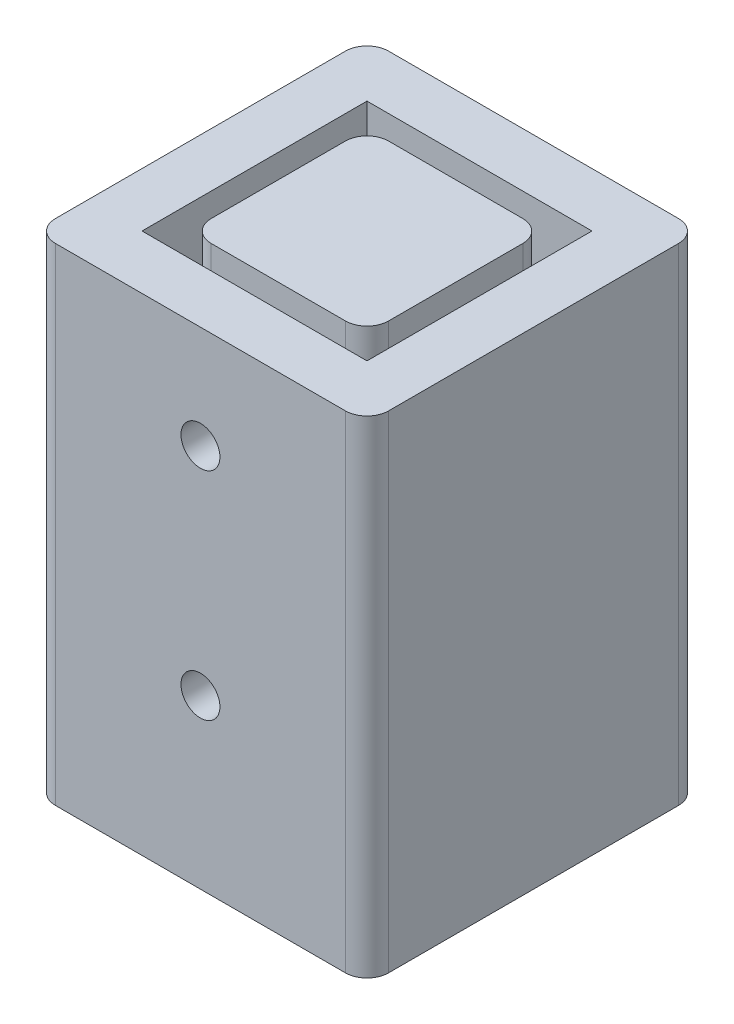
ISO-10303-21;
HEADER;
FILE_DESCRIPTION(('STEP AP214'),'2;1');
FILE_NAME('part.step','',(''),(''),'','','');
FILE_SCHEMA(('AUTOMOTIVE_DESIGN { 1 0 10303 214 1 1 1 1 }'));
ENDSEC;
DATA;
#1=APPLICATION_CONTEXT('core data for automotive mechanical design processes');
#2=APPLICATION_PROTOCOL_DEFINITION('international standard','automotive_design',2000,#1);
#3=PRODUCT_CONTEXT('',#1,'mechanical');
#4=PRODUCT('Part','Part','',(#3));
#5=PRODUCT_RELATED_PRODUCT_CATEGORY('part','',(#4));
#6=PRODUCT_DEFINITION_FORMATION('','',#4);
#7=PRODUCT_DEFINITION_CONTEXT('part definition',#1,'design');
#8=PRODUCT_DEFINITION('design','',#6,#7);
#9=PRODUCT_DEFINITION_SHAPE('','',#8);
#10=(LENGTH_UNIT() NAMED_UNIT(*) SI_UNIT(.MILLI.,.METRE.));
#11=(NAMED_UNIT(*) PLANE_ANGLE_UNIT() SI_UNIT($,.RADIAN.));
#12=(NAMED_UNIT(*) SI_UNIT($,.STERADIAN.) SOLID_ANGLE_UNIT());
#13=UNCERTAINTY_MEASURE_WITH_UNIT(LENGTH_MEASURE(1.E-05),#10,'distance_accuracy_value','');
#14=(GEOMETRIC_REPRESENTATION_CONTEXT(3) GLOBAL_UNCERTAINTY_ASSIGNED_CONTEXT((#13)) GLOBAL_UNIT_ASSIGNED_CONTEXT((#10,
#11,#12)) REPRESENTATION_CONTEXT('',''));
#15=CARTESIAN_POINT('',(0.,0.,0.));
#16=DIRECTION('',(0.,0.,1.));
#17=DIRECTION('',(1.,0.,0.));
#18=AXIS2_PLACEMENT_3D('',#15,#16,#17);
#19=CARTESIAN_POINT('',(0.,50.8,-10.414));
#20=DIRECTION('',(0.,0.,1.));
#21=DIRECTION('',(1.,0.,0.));
#22=AXIS2_PLACEMENT_3D('',#19,#20,#21);
#23=PLANE('',#22);
#24=CARTESIAN_POINT('',(0.,13.335,-10.414));
#25=DIRECTION('',(0.,0.,1.));
#26=DIRECTION('',(1.,0.,0.));
#27=AXIS2_PLACEMENT_3D('',#24,#25,#26);
#28=CIRCLE('',#27,2.286);
#29=CARTESIAN_POINT('',(2.286,13.335,-10.414));
#30=VERTEX_POINT('',#29);
#31=EDGE_CURVE('E268',#30,#30,#28,.T.);
#32=ORIENTED_EDGE('',*,*,#31,.T.);
#33=EDGE_LOOP('',(#32));
#34=FACE_BOUND('',#33,.T.);
#35=CARTESIAN_POINT('',(0.,38.735,-10.414));
#36=DIRECTION('',(0.,0.,1.));
#37=DIRECTION('',(1.,0.,0.));
#38=AXIS2_PLACEMENT_3D('',#35,#36,#37);
#39=CIRCLE('',#38,2.286);
#40=CARTESIAN_POINT('',(2.286,38.735,-10.414));
#41=VERTEX_POINT('',#40);
#42=EDGE_CURVE('E264',#41,#41,#39,.T.);
#43=ORIENTED_EDGE('',*,*,#42,.T.);
#44=EDGE_LOOP('',(#43));
#45=FACE_BOUND('',#44,.T.);
#46=DIRECTION('',(-1.,0.,0.));
#47=VECTOR('',#46,1.);
#48=CARTESIAN_POINT('',(0.,0.,-10.414));
#49=LINE('',#48,#47);
#50=CARTESIAN_POINT('',(7.874,0.,-10.414));
#51=VERTEX_POINT('',#50);
#52=CARTESIAN_POINT('',(-7.874,0.,-10.414));
#53=VERTEX_POINT('',#52);
#54=EDGE_CURVE('E271',#51,#53,#49,.T.);
#55=ORIENTED_EDGE('',*,*,#54,.T.);
#56=DIRECTION('',(0.,-1.,0.));
#57=VECTOR('',#56,1.);
#58=CARTESIAN_POINT('',(-7.874,50.8,-10.414));
#59=LINE('',#58,#57);
#60=CARTESIAN_POINT('',(-7.874,50.8,-10.414));
#61=VERTEX_POINT('',#60);
#62=EDGE_CURVE('E307',#53,#61,#59,.F.);
#63=ORIENTED_EDGE('',*,*,#62,.T.);
#64=DIRECTION('',(-1.,0.,0.));
#65=VECTOR('',#64,1.);
#66=CARTESIAN_POINT('',(0.,50.8,-10.414));
#67=LINE('',#66,#65);
#68=CARTESIAN_POINT('',(7.874,50.8,-10.414));
#69=VERTEX_POINT('',#68);
#70=EDGE_CURVE('E272',#69,#61,#67,.T.);
#71=ORIENTED_EDGE('',*,*,#70,.F.);
#72=DIRECTION('',(0.,-1.,0.));
#73=VECTOR('',#72,1.);
#74=CARTESIAN_POINT('',(7.874,0.,-10.414));
#75=LINE('',#74,#73);
#76=EDGE_CURVE('E304',#69,#51,#75,.T.);
#77=ORIENTED_EDGE('',*,*,#76,.T.);
#78=EDGE_LOOP('',(#55,#63,#71,#77));
#79=FACE_BOUND('',#78,.T.);
#80=ADVANCED_FACE('F61',(#34,#45,#79),#23,.F.);
#81=CARTESIAN_POINT('',(-10.414,50.8,0.));
#82=DIRECTION('',(1.,0.,0.));
#83=DIRECTION('',(0.,0.,-1.));
#84=AXIS2_PLACEMENT_3D('',#81,#82,#83);
#85=PLANE('',#84);
#86=DIRECTION('',(0.,0.,1.));
#87=VECTOR('',#86,1.);
#88=CARTESIAN_POINT('',(-10.414,50.8,0.));
#89=LINE('',#88,#87);
#90=CARTESIAN_POINT('',(-10.414,50.8,-7.874));
#91=VERTEX_POINT('',#90);
#92=CARTESIAN_POINT('',(-10.414,50.8,7.874));
#93=VERTEX_POINT('',#92);
#94=EDGE_CURVE('E275',#91,#93,#89,.T.);
#95=ORIENTED_EDGE('',*,*,#94,.F.);
#96=DIRECTION('',(0.,-1.,0.));
#97=VECTOR('',#96,1.);
#98=CARTESIAN_POINT('',(-10.414,50.8,-7.874));
#99=LINE('',#98,#97);
#100=CARTESIAN_POINT('',(-10.414,0.,-7.874));
#101=VERTEX_POINT('',#100);
#102=EDGE_CURVE('E301',#91,#101,#99,.T.);
#103=ORIENTED_EDGE('',*,*,#102,.T.);
#104=DIRECTION('',(0.,0.,1.));
#105=VECTOR('',#104,1.);
#106=CARTESIAN_POINT('',(-10.414,0.,0.));
#107=LINE('',#106,#105);
#108=CARTESIAN_POINT('',(-10.414,0.,7.874));
#109=VERTEX_POINT('',#108);
#110=EDGE_CURVE('E288',#101,#109,#107,.T.);
#111=ORIENTED_EDGE('',*,*,#110,.T.);
#112=DIRECTION('',(0.,-1.,0.));
#113=VECTOR('',#112,1.);
#114=CARTESIAN_POINT('',(-10.414,50.8,7.874));
#115=LINE('',#114,#113);
#116=EDGE_CURVE('E285',#109,#93,#115,.F.);
#117=ORIENTED_EDGE('',*,*,#116,.T.);
#118=EDGE_LOOP('',(#95,#103,#111,#117));
#119=FACE_BOUND('',#118,.T.);
#120=ADVANCED_FACE('F374',(#119),#85,.F.);
#121=CARTESIAN_POINT('',(0.,50.8,10.414));
#122=DIRECTION('',(0.,0.,1.));
#123=DIRECTION('',(1.,0.,0.));
#124=AXIS2_PLACEMENT_3D('',#121,#122,#123);
#125=PLANE('',#124);
#126=CARTESIAN_POINT('',(0.,13.335,10.414));
#127=DIRECTION('',(0.,0.,1.));
#128=DIRECTION('',(1.,0.,0.));
#129=AXIS2_PLACEMENT_3D('',#126,#127,#128);
#130=CIRCLE('',#129,2.286);
#131=CARTESIAN_POINT('',(2.286,13.335,10.414));
#132=VERTEX_POINT('',#131);
#133=EDGE_CURVE('E267',#132,#132,#130,.T.);
#134=ORIENTED_EDGE('',*,*,#133,.F.);
#135=EDGE_LOOP('',(#134));
#136=FACE_BOUND('',#135,.T.);
#137=CARTESIAN_POINT('',(0.,38.735,10.414));
#138=DIRECTION('',(0.,0.,1.));
#139=DIRECTION('',(1.,0.,0.));
#140=AXIS2_PLACEMENT_3D('',#137,#138,#139);
#141=CIRCLE('',#140,2.286);
#142=CARTESIAN_POINT('',(2.286,38.735,10.414));
#143=VERTEX_POINT('',#142);
#144=EDGE_CURVE('E263',#143,#143,#141,.T.);
#145=ORIENTED_EDGE('',*,*,#144,.F.);
#146=EDGE_LOOP('',(#145));
#147=FACE_BOUND('',#146,.T.);
#148=DIRECTION('',(-1.,0.,0.));
#149=VECTOR('',#148,1.);
#150=CARTESIAN_POINT('',(0.,50.8,10.414));
#151=LINE('',#150,#149);
#152=CARTESIAN_POINT('',(7.874,50.8,10.414));
#153=VERTEX_POINT('',#152);
#154=CARTESIAN_POINT('',(-7.874,50.8,10.414));
#155=VERTEX_POINT('',#154);
#156=EDGE_CURVE('E279',#153,#155,#151,.T.);
#157=ORIENTED_EDGE('',*,*,#156,.T.);
#158=DIRECTION('',(0.,-1.,0.));
#159=VECTOR('',#158,1.);
#160=CARTESIAN_POINT('',(-7.874,0.,10.414));
#161=LINE('',#160,#159);
#162=CARTESIAN_POINT('',(-7.874,0.,10.414));
#163=VERTEX_POINT('',#162);
#164=EDGE_CURVE('E324',#155,#163,#161,.T.);
#165=ORIENTED_EDGE('',*,*,#164,.T.);
#166=DIRECTION('',(-1.,0.,0.));
#167=VECTOR('',#166,1.);
#168=CARTESIAN_POINT('',(0.,0.,10.414));
#169=LINE('',#168,#167);
#170=CARTESIAN_POINT('',(7.874,0.,10.414));
#171=VERTEX_POINT('',#170);
#172=EDGE_CURVE('E291',#171,#163,#169,.T.);
#173=ORIENTED_EDGE('',*,*,#172,.F.);
#174=DIRECTION('',(0.,-1.,0.));
#175=VECTOR('',#174,1.);
#176=CARTESIAN_POINT('',(7.874,50.8,10.414));
#177=LINE('',#176,#175);
#178=EDGE_CURVE('E322',#171,#153,#177,.F.);
#179=ORIENTED_EDGE('',*,*,#178,.T.);
#180=EDGE_LOOP('',(#157,#165,#173,#179));
#181=FACE_BOUND('',#180,.T.);
#182=ADVANCED_FACE('F383',(#136,#147,#181),#125,.T.);
#183=CARTESIAN_POINT('',(10.414,50.8,0.));
#184=DIRECTION('',(1.,0.,0.));
#185=DIRECTION('',(0.,0.,-1.));
#186=AXIS2_PLACEMENT_3D('',#183,#184,#185);
#187=PLANE('',#186);
#188=DIRECTION('',(0.,0.,1.));
#189=VECTOR('',#188,1.);
#190=CARTESIAN_POINT('',(10.414,0.,0.));
#191=LINE('',#190,#189);
#192=CARTESIAN_POINT('',(10.414,0.,-7.874));
#193=VERTEX_POINT('',#192);
#194=CARTESIAN_POINT('',(10.414,0.,7.874));
#195=VERTEX_POINT('',#194);
#196=EDGE_CURVE('E276',#193,#195,#191,.T.);
#197=ORIENTED_EDGE('',*,*,#196,.F.);
#198=DIRECTION('',(0.,-1.,0.));
#199=VECTOR('',#198,1.);
#200=CARTESIAN_POINT('',(10.414,50.8,-7.874));
#201=LINE('',#200,#199);
#202=CARTESIAN_POINT('',(10.414,50.8,-7.874));
#203=VERTEX_POINT('',#202);
#204=EDGE_CURVE('E320',#193,#203,#201,.F.);
#205=ORIENTED_EDGE('',*,*,#204,.T.);
#206=DIRECTION('',(0.,0.,1.));
#207=VECTOR('',#206,1.);
#208=CARTESIAN_POINT('',(10.414,50.8,0.));
#209=LINE('',#208,#207);
#210=CARTESIAN_POINT('',(10.414,50.8,7.874));
#211=VERTEX_POINT('',#210);
#212=EDGE_CURVE('E282',#203,#211,#209,.T.);
#213=ORIENTED_EDGE('',*,*,#212,.T.);
#214=DIRECTION('',(0.,-1.,0.));
#215=VECTOR('',#214,1.);
#216=CARTESIAN_POINT('',(10.414,50.8,7.874));
#217=LINE('',#216,#215);
#218=EDGE_CURVE('E317',#211,#195,#217,.T.);
#219=ORIENTED_EDGE('',*,*,#218,.T.);
#220=EDGE_LOOP('',(#197,#205,#213,#219));
#221=FACE_BOUND('',#220,.T.);
#222=ADVANCED_FACE('F392',(#221),#187,.T.);
#223=CARTESIAN_POINT('',(0.,50.8,0.));
#224=DIRECTION('',(0.,1.,0.));
#225=DIRECTION('',(0.,0.,1.));
#226=AXIS2_PLACEMENT_3D('',#223,#224,#225);
#227=PLANE('',#226);
#228=ORIENTED_EDGE('',*,*,#70,.T.);
#229=CARTESIAN_POINT('',(-7.874,50.8,-7.874));
#230=DIRECTION('',(0.,1.,0.));
#231=DIRECTION('',(0.,0.,1.));
#232=AXIS2_PLACEMENT_3D('',#229,#230,#231);
#233=CIRCLE('',#232,2.54);
#234=EDGE_CURVE('E315',#61,#91,#233,.T.);
#235=ORIENTED_EDGE('',*,*,#234,.T.);
#236=ORIENTED_EDGE('',*,*,#94,.T.);
#237=CARTESIAN_POINT('',(-7.874,50.8,7.874));
#238=DIRECTION('',(0.,1.,0.));
#239=DIRECTION('',(0.,0.,1.));
#240=AXIS2_PLACEMENT_3D('',#237,#238,#239);
#241=CIRCLE('',#240,2.54);
#242=EDGE_CURVE('E311',#93,#155,#241,.T.);
#243=ORIENTED_EDGE('',*,*,#242,.T.);
#244=ORIENTED_EDGE('',*,*,#156,.F.);
#245=CARTESIAN_POINT('',(7.874,50.8,7.874));
#246=DIRECTION('',(0.,1.,0.));
#247=DIRECTION('',(0.,0.,1.));
#248=AXIS2_PLACEMENT_3D('',#245,#246,#247);
#249=CIRCLE('',#248,2.54);
#250=EDGE_CURVE('E309',#153,#211,#249,.T.);
#251=ORIENTED_EDGE('',*,*,#250,.T.);
#252=ORIENTED_EDGE('',*,*,#212,.F.);
#253=CARTESIAN_POINT('',(7.874,50.8,-7.874));
#254=DIRECTION('',(0.,1.,0.));
#255=DIRECTION('',(0.,0.,1.));
#256=AXIS2_PLACEMENT_3D('',#253,#254,#255);
#257=CIRCLE('',#256,2.54);
#258=EDGE_CURVE('E313',#203,#69,#257,.T.);
#259=ORIENTED_EDGE('',*,*,#258,.T.);
#260=EDGE_LOOP('',(#228,#235,#236,#243,#244,#251,#252,#259));
#261=FACE_BOUND('',#260,.T.);
#262=ADVANCED_FACE('F380',(#261),#227,.T.);
#263=CARTESIAN_POINT('',(0.,38.735,-19.558));
#264=DIRECTION('',(0.,0.,1.));
#265=DIRECTION('',(1.,0.,0.));
#266=AXIS2_PLACEMENT_3D('',#263,#264,#265);
#267=CYLINDRICAL_SURFACE('',#266,2.286);
#268=ORIENTED_EDGE('',*,*,#144,.T.);
#269=EDGE_LOOP('',(#268));
#270=FACE_BOUND('',#269,.T.);
#271=ORIENTED_EDGE('',*,*,#42,.F.);
#272=EDGE_LOOP('',(#271));
#273=FACE_BOUND('',#272,.T.);
#274=ADVANCED_FACE('F430',(#270,#273),#267,.F.);
#275=CARTESIAN_POINT('',(0.,13.335,-19.558));
#276=DIRECTION('',(0.,0.,1.));
#277=DIRECTION('',(1.,0.,0.));
#278=AXIS2_PLACEMENT_3D('',#275,#276,#277);
#279=CYLINDRICAL_SURFACE('',#278,2.286);
#280=ORIENTED_EDGE('',*,*,#133,.T.);
#281=EDGE_LOOP('',(#280));
#282=FACE_BOUND('',#281,.T.);
#283=ORIENTED_EDGE('',*,*,#31,.F.);
#284=EDGE_LOOP('',(#283));
#285=FACE_BOUND('',#284,.T.);
#286=ADVANCED_FACE('F433',(#282,#285),#279,.F.);
#287=CARTESIAN_POINT('',(0.,0.,0.));
#288=DIRECTION('',(0.,1.,0.));
#289=DIRECTION('',(0.,0.,1.));
#290=AXIS2_PLACEMENT_3D('',#287,#288,#289);
#291=PLANE('',#290);
#292=DIRECTION('',(0.,0.,-1.));
#293=VECTOR('',#292,1.);
#294=CARTESIAN_POINT('',(13.208,0.,0.));
#295=LINE('',#294,#293);
#296=CARTESIAN_POINT('',(13.208,0.,13.208));
#297=VERTEX_POINT('',#296);
#298=CARTESIAN_POINT('',(13.208,0.,-13.208));
#299=VERTEX_POINT('',#298);
#300=EDGE_CURVE('E204',#297,#299,#295,.T.);
#301=ORIENTED_EDGE('',*,*,#300,.T.);
#302=DIRECTION('',(1.,0.,0.));
#303=VECTOR('',#302,1.);
#304=CARTESIAN_POINT('',(0.,0.,-13.208));
#305=LINE('',#304,#303);
#306=CARTESIAN_POINT('',(-13.208,0.,-13.208));
#307=VERTEX_POINT('',#306);
#308=EDGE_CURVE('E236',#307,#299,#305,.T.);
#309=ORIENTED_EDGE('',*,*,#308,.F.);
#310=DIRECTION('',(0.,0.,-1.));
#311=VECTOR('',#310,1.);
#312=CARTESIAN_POINT('',(-13.208,0.,0.));
#313=LINE('',#312,#311);
#314=CARTESIAN_POINT('',(-13.208,0.,13.208));
#315=VERTEX_POINT('',#314);
#316=EDGE_CURVE('E234',#315,#307,#313,.T.);
#317=ORIENTED_EDGE('',*,*,#316,.F.);
#318=DIRECTION('',(1.,0.,0.));
#319=VECTOR('',#318,1.);
#320=CARTESIAN_POINT('',(0.,0.,13.208));
#321=LINE('',#320,#319);
#322=EDGE_CURVE('E231',#315,#297,#321,.T.);
#323=ORIENTED_EDGE('',*,*,#322,.T.);
#324=EDGE_LOOP('',(#301,#309,#317,#323));
#325=FACE_BOUND('',#324,.T.);
#326=ORIENTED_EDGE('',*,*,#54,.F.);
#327=CARTESIAN_POINT('',(7.874,0.,-7.874));
#328=DIRECTION('',(0.,1.,0.));
#329=DIRECTION('',(0.,0.,1.));
#330=AXIS2_PLACEMENT_3D('',#327,#328,#329);
#331=CIRCLE('',#330,2.54);
#332=EDGE_CURVE('E363',#51,#193,#331,.F.);
#333=ORIENTED_EDGE('',*,*,#332,.T.);
#334=ORIENTED_EDGE('',*,*,#196,.T.);
#335=CARTESIAN_POINT('',(7.874,0.,7.874));
#336=DIRECTION('',(0.,1.,0.));
#337=DIRECTION('',(0.,0.,1.));
#338=AXIS2_PLACEMENT_3D('',#335,#336,#337);
#339=CIRCLE('',#338,2.54);
#340=EDGE_CURVE('E12',#195,#171,#339,.F.);
#341=ORIENTED_EDGE('',*,*,#340,.T.);
#342=ORIENTED_EDGE('',*,*,#172,.T.);
#343=CARTESIAN_POINT('',(-7.874,0.,7.874));
#344=DIRECTION('',(0.,1.,0.));
#345=DIRECTION('',(0.,0.,1.));
#346=AXIS2_PLACEMENT_3D('',#343,#344,#345);
#347=CIRCLE('',#346,2.54);
#348=EDGE_CURVE('E69',#163,#109,#347,.F.);
#349=ORIENTED_EDGE('',*,*,#348,.T.);
#350=ORIENTED_EDGE('',*,*,#110,.F.);
#351=CARTESIAN_POINT('',(-7.874,0.,-7.874));
#352=DIRECTION('',(0.,1.,0.));
#353=DIRECTION('',(0.,0.,1.));
#354=AXIS2_PLACEMENT_3D('',#351,#352,#353);
#355=CIRCLE('',#354,2.54);
#356=EDGE_CURVE('E361',#101,#53,#355,.F.);
#357=ORIENTED_EDGE('',*,*,#356,.T.);
#358=EDGE_LOOP('',(#326,#333,#334,#341,#342,#349,#350,#357));
#359=FACE_BOUND('',#358,.T.);
#360=ADVANCED_FACE('F367',(#325,#359),#291,.T.);
#361=CARTESIAN_POINT('',(13.208,50.8,0.));
#362=DIRECTION('',(-1.,0.,0.));
#363=DIRECTION('',(0.,0.,1.));
#364=AXIS2_PLACEMENT_3D('',#361,#362,#363);
#365=PLANE('',#364);
#366=ORIENTED_EDGE('',*,*,#300,.F.);
#367=DIRECTION('',(0.,-1.,0.));
#368=VECTOR('',#367,1.);
#369=CARTESIAN_POINT('',(13.208,50.8,13.208));
#370=LINE('',#369,#368);
#371=CARTESIAN_POINT('',(13.208,50.8,13.208));
#372=VERTEX_POINT('',#371);
#373=EDGE_CURVE('E199',#372,#297,#370,.T.);
#374=ORIENTED_EDGE('',*,*,#373,.F.);
#375=DIRECTION('',(0.,0.,-1.));
#376=VECTOR('',#375,1.);
#377=CARTESIAN_POINT('',(13.208,50.8,0.));
#378=LINE('',#377,#376);
#379=CARTESIAN_POINT('',(13.208,50.8,-13.208));
#380=VERTEX_POINT('',#379);
#381=EDGE_CURVE('E202',#372,#380,#378,.T.);
#382=ORIENTED_EDGE('',*,*,#381,.T.);
#383=DIRECTION('',(0.,-1.,0.));
#384=VECTOR('',#383,1.);
#385=CARTESIAN_POINT('',(13.208,50.8,-13.208));
#386=LINE('',#385,#384);
#387=EDGE_CURVE('E229',#380,#299,#386,.T.);
#388=ORIENTED_EDGE('',*,*,#387,.T.);
#389=EDGE_LOOP('',(#366,#374,#382,#388));
#390=FACE_BOUND('',#389,.T.);
#391=ADVANCED_FACE('F201',(#390),#365,.T.);
#392=CARTESIAN_POINT('',(0.,50.8,13.208));
#393=DIRECTION('',(0.,0.,-1.));
#394=DIRECTION('',(-1.,0.,0.));
#395=AXIS2_PLACEMENT_3D('',#392,#393,#394);
#396=PLANE('',#395);
#397=CARTESIAN_POINT('',(0.,13.335,13.208));
#398=DIRECTION('',(0.,0.,-1.));
#399=DIRECTION('',(-1.,0.,0.));
#400=AXIS2_PLACEMENT_3D('',#397,#398,#399);
#401=CIRCLE('',#400,2.286);
#402=CARTESIAN_POINT('',(-2.286,13.335,13.208));
#403=VERTEX_POINT('',#402);
#404=EDGE_CURVE('E232',#403,#403,#401,.T.);
#405=ORIENTED_EDGE('',*,*,#404,.F.);
#406=EDGE_LOOP('',(#405));
#407=FACE_BOUND('',#406,.T.);
#408=CARTESIAN_POINT('',(0.,38.735,13.208));
#409=DIRECTION('',(0.,0.,-1.));
#410=DIRECTION('',(-1.,0.,0.));
#411=AXIS2_PLACEMENT_3D('',#408,#409,#410);
#412=CIRCLE('',#411,2.286);
#413=CARTESIAN_POINT('',(-2.286,38.735,13.208));
#414=VERTEX_POINT('',#413);
#415=EDGE_CURVE('E248',#414,#414,#412,.T.);
#416=ORIENTED_EDGE('',*,*,#415,.F.);
#417=EDGE_LOOP('',(#416));
#418=FACE_BOUND('',#417,.T.);
#419=ORIENTED_EDGE('',*,*,#322,.F.);
#420=DIRECTION('',(0.,-1.,0.));
#421=VECTOR('',#420,1.);
#422=CARTESIAN_POINT('',(-13.208,50.8,13.208));
#423=LINE('',#422,#421);
#424=CARTESIAN_POINT('',(-13.208,50.8,13.208));
#425=VERTEX_POINT('',#424);
#426=EDGE_CURVE('E210',#425,#315,#423,.T.);
#427=ORIENTED_EDGE('',*,*,#426,.F.);
#428=DIRECTION('',(1.,0.,0.));
#429=VECTOR('',#428,1.);
#430=CARTESIAN_POINT('',(0.,50.8,13.208));
#431=LINE('',#430,#429);
#432=EDGE_CURVE('E216',#425,#372,#431,.T.);
#433=ORIENTED_EDGE('',*,*,#432,.T.);
#434=ORIENTED_EDGE('',*,*,#373,.T.);
#435=EDGE_LOOP('',(#419,#427,#433,#434));
#436=FACE_BOUND('',#435,.T.);
#437=ADVANCED_FACE('F221',(#407,#418,#436),#396,.T.);
#438=CARTESIAN_POINT('',(-13.208,50.8,0.));
#439=DIRECTION('',(-1.,0.,0.));
#440=DIRECTION('',(0.,0.,1.));
#441=AXIS2_PLACEMENT_3D('',#438,#439,#440);
#442=PLANE('',#441);
#443=ORIENTED_EDGE('',*,*,#316,.T.);
#444=DIRECTION('',(0.,-1.,0.));
#445=VECTOR('',#444,1.);
#446=CARTESIAN_POINT('',(-13.208,50.8,-13.208));
#447=LINE('',#446,#445);
#448=CARTESIAN_POINT('',(-13.208,50.8,-13.208));
#449=VERTEX_POINT('',#448);
#450=EDGE_CURVE('E241',#449,#307,#447,.T.);
#451=ORIENTED_EDGE('',*,*,#450,.F.);
#452=DIRECTION('',(0.,0.,-1.));
#453=VECTOR('',#452,1.);
#454=CARTESIAN_POINT('',(-13.208,50.8,0.));
#455=LINE('',#454,#453);
#456=EDGE_CURVE('E223',#425,#449,#455,.T.);
#457=ORIENTED_EDGE('',*,*,#456,.F.);
#458=ORIENTED_EDGE('',*,*,#426,.T.);
#459=EDGE_LOOP('',(#443,#451,#457,#458));
#460=FACE_BOUND('',#459,.T.);
#461=ADVANCED_FACE('F459',(#460),#442,.F.);
#462=CARTESIAN_POINT('',(0.,50.8,-13.208));
#463=DIRECTION('',(0.,0.,-1.));
#464=DIRECTION('',(-1.,0.,0.));
#465=AXIS2_PLACEMENT_3D('',#462,#463,#464);
#466=PLANE('',#465);
#467=CARTESIAN_POINT('',(0.,13.335,-13.208));
#468=DIRECTION('',(0.,0.,-1.));
#469=DIRECTION('',(-1.,0.,0.));
#470=AXIS2_PLACEMENT_3D('',#467,#468,#469);
#471=CIRCLE('',#470,2.286);
#472=CARTESIAN_POINT('',(-2.286,13.335,-13.208));
#473=VERTEX_POINT('',#472);
#474=EDGE_CURVE('E250',#473,#473,#471,.T.);
#475=ORIENTED_EDGE('',*,*,#474,.T.);
#476=EDGE_LOOP('',(#475));
#477=FACE_BOUND('',#476,.T.);
#478=CARTESIAN_POINT('',(0.,38.735,-13.208));
#479=DIRECTION('',(0.,0.,-1.));
#480=DIRECTION('',(-1.,0.,0.));
#481=AXIS2_PLACEMENT_3D('',#478,#479,#480);
#482=CIRCLE('',#481,2.286);
#483=CARTESIAN_POINT('',(-2.286,38.735,-13.208));
#484=VERTEX_POINT('',#483);
#485=EDGE_CURVE('E245',#484,#484,#482,.T.);
#486=ORIENTED_EDGE('',*,*,#485,.T.);
#487=EDGE_LOOP('',(#486));
#488=FACE_BOUND('',#487,.T.);
#489=ORIENTED_EDGE('',*,*,#308,.T.);
#490=ORIENTED_EDGE('',*,*,#387,.F.);
#491=DIRECTION('',(1.,0.,0.));
#492=VECTOR('',#491,1.);
#493=CARTESIAN_POINT('',(0.,50.8,-13.208));
#494=LINE('',#493,#492);
#495=EDGE_CURVE('E217',#449,#380,#494,.T.);
#496=ORIENTED_EDGE('',*,*,#495,.F.);
#497=ORIENTED_EDGE('',*,*,#450,.T.);
#498=EDGE_LOOP('',(#489,#490,#496,#497));
#499=FACE_BOUND('',#498,.T.);
#500=ADVANCED_FACE('F463',(#477,#488,#499),#466,.F.);
#501=CARTESIAN_POINT('',(0.,50.8,0.));
#502=DIRECTION('',(0.,1.,0.));
#503=DIRECTION('',(0.,0.,1.));
#504=AXIS2_PLACEMENT_3D('',#501,#502,#503);
#505=PLANE('',#504);
#506=DIRECTION('',(0.,0.,-1.));
#507=VECTOR('',#506,1.);
#508=CARTESIAN_POINT('',(19.558,50.8,0.));
#509=LINE('',#508,#507);
#510=CARTESIAN_POINT('',(19.558,50.8,17.018));
#511=VERTEX_POINT('',#510);
#512=CARTESIAN_POINT('',(19.558,50.8,-17.018));
#513=VERTEX_POINT('',#512);
#514=EDGE_CURVE('E520',#511,#513,#509,.T.);
#515=ORIENTED_EDGE('',*,*,#514,.T.);
#516=CARTESIAN_POINT('',(17.018,50.8,-17.018));
#517=DIRECTION('',(0.,1.,0.));
#518=DIRECTION('',(0.,0.,1.));
#519=AXIS2_PLACEMENT_3D('',#516,#517,#518);
#520=CIRCLE('',#519,2.54);
#521=CARTESIAN_POINT('',(17.018,50.8,-19.558));
#522=VERTEX_POINT('',#521);
#523=EDGE_CURVE('E338',#513,#522,#520,.T.);
#524=ORIENTED_EDGE('',*,*,#523,.T.);
#525=DIRECTION('',(1.,0.,0.));
#526=VECTOR('',#525,1.);
#527=CARTESIAN_POINT('',(0.,50.8,-19.558));
#528=LINE('',#527,#526);
#529=CARTESIAN_POINT('',(-17.018,50.8,-19.558));
#530=VERTEX_POINT('',#529);
#531=EDGE_CURVE('E219',#530,#522,#528,.T.);
#532=ORIENTED_EDGE('',*,*,#531,.F.);
#533=CARTESIAN_POINT('',(-17.018,50.8,-17.018));
#534=DIRECTION('',(0.,1.,0.));
#535=DIRECTION('',(0.,0.,1.));
#536=AXIS2_PLACEMENT_3D('',#533,#534,#535);
#537=CIRCLE('',#536,2.54);
#538=CARTESIAN_POINT('',(-19.558,50.8,-17.018));
#539=VERTEX_POINT('',#538);
#540=EDGE_CURVE('E336',#530,#539,#537,.T.);
#541=ORIENTED_EDGE('',*,*,#540,.T.);
#542=DIRECTION('',(0.,0.,-1.));
#543=VECTOR('',#542,1.);
#544=CARTESIAN_POINT('',(-19.558,50.8,0.));
#545=LINE('',#544,#543);
#546=CARTESIAN_POINT('',(-19.558,50.8,17.018));
#547=VERTEX_POINT('',#546);
#548=EDGE_CURVE('E239',#547,#539,#545,.T.);
#549=ORIENTED_EDGE('',*,*,#548,.F.);
#550=CARTESIAN_POINT('',(-17.018,50.8,17.018));
#551=DIRECTION('',(0.,1.,0.));
#552=DIRECTION('',(0.,0.,1.));
#553=AXIS2_PLACEMENT_3D('',#550,#551,#552);
#554=CIRCLE('',#553,2.54);
#555=CARTESIAN_POINT('',(-17.018,50.8,19.558));
#556=VERTEX_POINT('',#555);
#557=EDGE_CURVE('E332',#547,#556,#554,.T.);
#558=ORIENTED_EDGE('',*,*,#557,.T.);
#559=DIRECTION('',(1.,0.,0.));
#560=VECTOR('',#559,1.);
#561=CARTESIAN_POINT('',(0.,50.8,19.558));
#562=LINE('',#561,#560);
#563=CARTESIAN_POINT('',(17.018,50.8,19.558));
#564=VERTEX_POINT('',#563);
#565=EDGE_CURVE('E517',#556,#564,#562,.T.);
#566=ORIENTED_EDGE('',*,*,#565,.T.);
#567=CARTESIAN_POINT('',(17.018,50.8,17.018));
#568=DIRECTION('',(0.,1.,0.));
#569=DIRECTION('',(0.,0.,1.));
#570=AXIS2_PLACEMENT_3D('',#567,#568,#569);
#571=CIRCLE('',#570,2.54);
#572=EDGE_CURVE('E334',#564,#511,#571,.T.);
#573=ORIENTED_EDGE('',*,*,#572,.T.);
#574=EDGE_LOOP('',(#515,#524,#532,#541,#549,#558,#566,#573));
#575=FACE_BOUND('',#574,.T.);
#576=ORIENTED_EDGE('',*,*,#381,.F.);
#577=ORIENTED_EDGE('',*,*,#432,.F.);
#578=ORIENTED_EDGE('',*,*,#456,.T.);
#579=ORIENTED_EDGE('',*,*,#495,.T.);
#580=EDGE_LOOP('',(#576,#577,#578,#579));
#581=FACE_BOUND('',#580,.T.);
#582=ADVANCED_FACE('F214',(#575,#581),#505,.T.);
#583=CARTESIAN_POINT('',(0.,38.735,-19.558));
#584=DIRECTION('',(0.,0.,1.));
#585=DIRECTION('',(1.,0.,0.));
#586=AXIS2_PLACEMENT_3D('',#583,#584,#585);
#587=CYLINDRICAL_SURFACE('',#586,2.286);
#588=CARTESIAN_POINT('',(0.,38.735,-19.558));
#589=DIRECTION('',(0.,0.,1.));
#590=DIRECTION('',(1.,0.,0.));
#591=AXIS2_PLACEMENT_3D('',#588,#589,#590);
#592=CIRCLE('',#591,2.286);
#593=CARTESIAN_POINT('',(2.286,38.735,-19.558));
#594=VERTEX_POINT('',#593);
#595=EDGE_CURVE('E504',#594,#594,#592,.T.);
#596=ORIENTED_EDGE('',*,*,#595,.F.);
#597=EDGE_LOOP('',(#596));
#598=FACE_BOUND('',#597,.T.);
#599=ORIENTED_EDGE('',*,*,#485,.F.);
#600=EDGE_LOOP('',(#599));
#601=FACE_BOUND('',#600,.T.);
#602=ADVANCED_FACE('F470',(#598,#601),#587,.F.);
#603=CARTESIAN_POINT('',(0.,13.335,-19.558));
#604=DIRECTION('',(0.,0.,1.));
#605=DIRECTION('',(1.,0.,0.));
#606=AXIS2_PLACEMENT_3D('',#603,#604,#605);
#607=CYLINDRICAL_SURFACE('',#606,2.286);
#608=CARTESIAN_POINT('',(0.,13.335,-19.558));
#609=DIRECTION('',(0.,0.,1.));
#610=DIRECTION('',(1.,0.,0.));
#611=AXIS2_PLACEMENT_3D('',#608,#609,#610);
#612=CIRCLE('',#611,2.286);
#613=CARTESIAN_POINT('',(2.286,13.335,-19.558));
#614=VERTEX_POINT('',#613);
#615=EDGE_CURVE('E249',#614,#614,#612,.T.);
#616=ORIENTED_EDGE('',*,*,#615,.F.);
#617=EDGE_LOOP('',(#616));
#618=FACE_BOUND('',#617,.T.);
#619=ORIENTED_EDGE('',*,*,#474,.F.);
#620=EDGE_LOOP('',(#619));
#621=FACE_BOUND('',#620,.T.);
#622=ADVANCED_FACE('F475',(#618,#621),#607,.F.);
#623=ORIENTED_EDGE('',*,*,#415,.T.);
#624=EDGE_LOOP('',(#623));
#625=FACE_BOUND('',#624,.T.);
#626=CARTESIAN_POINT('',(0.,38.735,19.558));
#627=DIRECTION('',(0.,0.,1.));
#628=DIRECTION('',(1.,0.,0.));
#629=AXIS2_PLACEMENT_3D('',#626,#627,#628);
#630=CIRCLE('',#629,2.286);
#631=CARTESIAN_POINT('',(2.286,38.735,19.558));
#632=VERTEX_POINT('',#631);
#633=EDGE_CURVE('E509',#632,#632,#630,.T.);
#634=ORIENTED_EDGE('',*,*,#633,.T.);
#635=EDGE_LOOP('',(#634));
#636=FACE_BOUND('',#635,.T.);
#637=ADVANCED_FACE('F472',(#625,#636),#587,.F.);
#638=ORIENTED_EDGE('',*,*,#404,.T.);
#639=EDGE_LOOP('',(#638));
#640=FACE_BOUND('',#639,.T.);
#641=CARTESIAN_POINT('',(0.,13.335,19.558));
#642=DIRECTION('',(0.,0.,1.));
#643=DIRECTION('',(1.,0.,0.));
#644=AXIS2_PLACEMENT_3D('',#641,#642,#643);
#645=CIRCLE('',#644,2.286);
#646=CARTESIAN_POINT('',(2.286,13.335,19.558));
#647=VERTEX_POINT('',#646);
#648=EDGE_CURVE('E501',#647,#647,#645,.T.);
#649=ORIENTED_EDGE('',*,*,#648,.T.);
#650=EDGE_LOOP('',(#649));
#651=FACE_BOUND('',#650,.T.);
#652=ADVANCED_FACE('F454',(#640,#651),#607,.F.);
#653=CARTESIAN_POINT('',(0.,-6.35,0.));
#654=DIRECTION('',(0.,1.,0.));
#655=DIRECTION('',(0.,0.,1.));
#656=AXIS2_PLACEMENT_3D('',#653,#654,#655);
#657=PLANE('',#656);
#658=DIRECTION('',(1.,0.,0.));
#659=VECTOR('',#658,1.);
#660=CARTESIAN_POINT('',(0.,-6.35,-19.558));
#661=LINE('',#660,#659);
#662=CARTESIAN_POINT('',(-17.018,-6.35,-19.558));
#663=VERTEX_POINT('',#662);
#664=CARTESIAN_POINT('',(17.018,-6.35,-19.558));
#665=VERTEX_POINT('',#664);
#666=EDGE_CURVE('E260',#663,#665,#661,.T.);
#667=ORIENTED_EDGE('',*,*,#666,.T.);
#668=CARTESIAN_POINT('',(17.018,-6.35,-17.018));
#669=DIRECTION('',(0.,1.,0.));
#670=DIRECTION('',(0.,0.,1.));
#671=AXIS2_PLACEMENT_3D('',#668,#669,#670);
#672=CIRCLE('',#671,2.54);
#673=CARTESIAN_POINT('',(19.558,-6.35,-17.018));
#674=VERTEX_POINT('',#673);
#675=EDGE_CURVE('E350',#665,#674,#672,.F.);
#676=ORIENTED_EDGE('',*,*,#675,.T.);
#677=DIRECTION('',(0.,0.,-1.));
#678=VECTOR('',#677,1.);
#679=CARTESIAN_POINT('',(19.558,-6.35,0.));
#680=LINE('',#679,#678);
#681=CARTESIAN_POINT('',(19.558,-6.35,17.018));
#682=VERTEX_POINT('',#681);
#683=EDGE_CURVE('E257',#682,#674,#680,.T.);
#684=ORIENTED_EDGE('',*,*,#683,.F.);
#685=CARTESIAN_POINT('',(17.018,-6.35,17.018));
#686=DIRECTION('',(0.,1.,0.));
#687=DIRECTION('',(0.,0.,1.));
#688=AXIS2_PLACEMENT_3D('',#685,#686,#687);
#689=CIRCLE('',#688,2.54);
#690=CARTESIAN_POINT('',(17.018,-6.35,19.558));
#691=VERTEX_POINT('',#690);
#692=EDGE_CURVE('E76',#682,#691,#689,.F.);
#693=ORIENTED_EDGE('',*,*,#692,.T.);
#694=DIRECTION('',(1.,0.,0.));
#695=VECTOR('',#694,1.);
#696=CARTESIAN_POINT('',(0.,-6.35,19.558));
#697=LINE('',#696,#695);
#698=CARTESIAN_POINT('',(-17.018,-6.35,19.558));
#699=VERTEX_POINT('',#698);
#700=EDGE_CURVE('E255',#699,#691,#697,.T.);
#701=ORIENTED_EDGE('',*,*,#700,.F.);
#702=CARTESIAN_POINT('',(-17.018,-6.35,17.018));
#703=DIRECTION('',(0.,1.,0.));
#704=DIRECTION('',(0.,0.,1.));
#705=AXIS2_PLACEMENT_3D('',#702,#703,#704);
#706=CIRCLE('',#705,2.54);
#707=CARTESIAN_POINT('',(-19.558,-6.35,17.018));
#708=VERTEX_POINT('',#707);
#709=EDGE_CURVE('E345',#699,#708,#706,.F.);
#710=ORIENTED_EDGE('',*,*,#709,.T.);
#711=DIRECTION('',(0.,0.,-1.));
#712=VECTOR('',#711,1.);
#713=CARTESIAN_POINT('',(-19.558,-6.35,0.));
#714=LINE('',#713,#712);
#715=CARTESIAN_POINT('',(-19.558,-6.35,-17.018));
#716=VERTEX_POINT('',#715);
#717=EDGE_CURVE('E209',#708,#716,#714,.T.);
#718=ORIENTED_EDGE('',*,*,#717,.T.);
#719=CARTESIAN_POINT('',(-17.018,-6.35,-17.018));
#720=DIRECTION('',(0.,1.,0.));
#721=DIRECTION('',(0.,0.,1.));
#722=AXIS2_PLACEMENT_3D('',#719,#720,#721);
#723=CIRCLE('',#722,2.54);
#724=EDGE_CURVE('E348',#716,#663,#723,.F.);
#725=ORIENTED_EDGE('',*,*,#724,.T.);
#726=EDGE_LOOP('',(#667,#676,#684,#693,#701,#710,#718,#725));
#727=FACE_BOUND('',#726,.T.);
#728=ADVANCED_FACE('F442',(#727),#657,.F.);
#729=CARTESIAN_POINT('',(0.,-6.35,19.558));
#730=DIRECTION('',(0.,0.,1.));
#731=DIRECTION('',(1.,0.,0.));
#732=AXIS2_PLACEMENT_3D('',#729,#730,#731);
#733=PLANE('',#732);
#734=ORIENTED_EDGE('',*,*,#700,.T.);
#735=DIRECTION('',(0.,1.,0.));
#736=VECTOR('',#735,1.);
#737=CARTESIAN_POINT('',(17.018,-6.35,19.558));
#738=LINE('',#737,#736);
#739=EDGE_CURVE('E358',#691,#564,#738,.T.);
#740=ORIENTED_EDGE('',*,*,#739,.T.);
#741=ORIENTED_EDGE('',*,*,#565,.F.);
#742=DIRECTION('',(0.,1.,0.));
#743=VECTOR('',#742,1.);
#744=CARTESIAN_POINT('',(-17.018,-6.35,19.558));
#745=LINE('',#744,#743);
#746=EDGE_CURVE('E83',#556,#699,#745,.F.);
#747=ORIENTED_EDGE('',*,*,#746,.T.);
#748=EDGE_LOOP('',(#734,#740,#741,#747));
#749=FACE_BOUND('',#748,.T.);
#750=ORIENTED_EDGE('',*,*,#648,.F.);
#751=EDGE_LOOP('',(#750));
#752=FACE_BOUND('',#751,.T.);
#753=ORIENTED_EDGE('',*,*,#633,.F.);
#754=EDGE_LOOP('',(#753));
#755=FACE_BOUND('',#754,.T.);
#756=ADVANCED_FACE('F438',(#749,#752,#755),#733,.T.);
#757=CARTESIAN_POINT('',(19.558,-6.35,0.));
#758=DIRECTION('',(1.,0.,0.));
#759=DIRECTION('',(0.,0.,-1.));
#760=AXIS2_PLACEMENT_3D('',#757,#758,#759);
#761=PLANE('',#760);
#762=ORIENTED_EDGE('',*,*,#683,.T.);
#763=DIRECTION('',(0.,1.,0.));
#764=VECTOR('',#763,1.);
#765=CARTESIAN_POINT('',(19.558,50.8,-17.018));
#766=LINE('',#765,#764);
#767=EDGE_CURVE('E329',#674,#513,#766,.T.);
#768=ORIENTED_EDGE('',*,*,#767,.T.);
#769=ORIENTED_EDGE('',*,*,#514,.F.);
#770=DIRECTION('',(0.,1.,0.));
#771=VECTOR('',#770,1.);
#772=CARTESIAN_POINT('',(19.558,-6.35,17.018));
#773=LINE('',#772,#771);
#774=EDGE_CURVE('E327',#511,#682,#773,.F.);
#775=ORIENTED_EDGE('',*,*,#774,.T.);
#776=EDGE_LOOP('',(#762,#768,#769,#775));
#777=FACE_BOUND('',#776,.T.);
#778=ADVANCED_FACE('F441',(#777),#761,.T.);
#779=CARTESIAN_POINT('',(0.,-6.35,-19.558));
#780=DIRECTION('',(0.,0.,1.));
#781=DIRECTION('',(1.,0.,0.));
#782=AXIS2_PLACEMENT_3D('',#779,#780,#781);
#783=PLANE('',#782);
#784=ORIENTED_EDGE('',*,*,#531,.T.);
#785=DIRECTION('',(0.,1.,0.));
#786=VECTOR('',#785,1.);
#787=CARTESIAN_POINT('',(17.018,-6.35,-19.558));
#788=LINE('',#787,#786);
#789=EDGE_CURVE('E343',#522,#665,#788,.F.);
#790=ORIENTED_EDGE('',*,*,#789,.T.);
#791=ORIENTED_EDGE('',*,*,#666,.F.);
#792=DIRECTION('',(0.,1.,0.));
#793=VECTOR('',#792,1.);
#794=CARTESIAN_POINT('',(-17.018,-6.35,-19.558));
#795=LINE('',#794,#793);
#796=EDGE_CURVE('E340',#663,#530,#795,.T.);
#797=ORIENTED_EDGE('',*,*,#796,.T.);
#798=EDGE_LOOP('',(#784,#790,#791,#797));
#799=FACE_BOUND('',#798,.T.);
#800=ORIENTED_EDGE('',*,*,#615,.T.);
#801=EDGE_LOOP('',(#800));
#802=FACE_BOUND('',#801,.T.);
#803=ORIENTED_EDGE('',*,*,#595,.T.);
#804=EDGE_LOOP('',(#803));
#805=FACE_BOUND('',#804,.T.);
#806=ADVANCED_FACE('F411',(#799,#802,#805),#783,.F.);
#807=CARTESIAN_POINT('',(-19.558,-6.35,0.));
#808=DIRECTION('',(1.,0.,0.));
#809=DIRECTION('',(0.,0.,-1.));
#810=AXIS2_PLACEMENT_3D('',#807,#808,#809);
#811=PLANE('',#810);
#812=ORIENTED_EDGE('',*,*,#548,.T.);
#813=DIRECTION('',(0.,1.,0.));
#814=VECTOR('',#813,1.);
#815=CARTESIAN_POINT('',(-19.558,-6.35,-17.018));
#816=LINE('',#815,#814);
#817=EDGE_CURVE('E355',#539,#716,#816,.F.);
#818=ORIENTED_EDGE('',*,*,#817,.T.);
#819=ORIENTED_EDGE('',*,*,#717,.F.);
#820=DIRECTION('',(0.,1.,0.));
#821=VECTOR('',#820,1.);
#822=CARTESIAN_POINT('',(-19.558,50.8,17.018));
#823=LINE('',#822,#821);
#824=EDGE_CURVE('E352',#708,#547,#823,.T.);
#825=ORIENTED_EDGE('',*,*,#824,.T.);
#826=EDGE_LOOP('',(#812,#818,#819,#825));
#827=FACE_BOUND('',#826,.T.);
#828=ADVANCED_FACE('F404',(#827),#811,.F.);
#829=CARTESIAN_POINT('',(-7.874,50.8,-7.874));
#830=DIRECTION('',(0.,-1.,0.));
#831=DIRECTION('',(0.,0.,-1.));
#832=AXIS2_PLACEMENT_3D('',#829,#830,#831);
#833=CYLINDRICAL_SURFACE('',#832,2.54);
#834=ORIENTED_EDGE('',*,*,#234,.F.);
#835=ORIENTED_EDGE('',*,*,#62,.F.);
#836=ORIENTED_EDGE('',*,*,#356,.F.);
#837=ORIENTED_EDGE('',*,*,#102,.F.);
#838=EDGE_LOOP('',(#834,#835,#836,#837));
#839=FACE_BOUND('',#838,.T.);
#840=ADVANCED_FACE('F402',(#839),#833,.T.);
#841=CARTESIAN_POINT('',(7.874,50.8,-7.874));
#842=DIRECTION('',(0.,1.,0.));
#843=DIRECTION('',(0.,0.,1.));
#844=AXIS2_PLACEMENT_3D('',#841,#842,#843);
#845=CYLINDRICAL_SURFACE('',#844,2.54);
#846=ORIENTED_EDGE('',*,*,#258,.F.);
#847=ORIENTED_EDGE('',*,*,#204,.F.);
#848=ORIENTED_EDGE('',*,*,#332,.F.);
#849=ORIENTED_EDGE('',*,*,#76,.F.);
#850=EDGE_LOOP('',(#846,#847,#848,#849));
#851=FACE_BOUND('',#850,.T.);
#852=ADVANCED_FACE('F395',(#851),#845,.T.);
#853=CARTESIAN_POINT('',(-7.874,50.8,7.874));
#854=DIRECTION('',(0.,1.,0.));
#855=DIRECTION('',(0.,0.,1.));
#856=AXIS2_PLACEMENT_3D('',#853,#854,#855);
#857=CYLINDRICAL_SURFACE('',#856,2.54);
#858=ORIENTED_EDGE('',*,*,#242,.F.);
#859=ORIENTED_EDGE('',*,*,#116,.F.);
#860=ORIENTED_EDGE('',*,*,#348,.F.);
#861=ORIENTED_EDGE('',*,*,#164,.F.);
#862=EDGE_LOOP('',(#858,#859,#860,#861));
#863=FACE_BOUND('',#862,.T.);
#864=ADVANCED_FACE('F377',(#863),#857,.T.);
#865=CARTESIAN_POINT('',(7.874,50.8,7.874));
#866=DIRECTION('',(0.,-1.,0.));
#867=DIRECTION('',(0.,0.,-1.));
#868=AXIS2_PLACEMENT_3D('',#865,#866,#867);
#869=CYLINDRICAL_SURFACE('',#868,2.54);
#870=ORIENTED_EDGE('',*,*,#250,.F.);
#871=ORIENTED_EDGE('',*,*,#178,.F.);
#872=ORIENTED_EDGE('',*,*,#340,.F.);
#873=ORIENTED_EDGE('',*,*,#218,.F.);
#874=EDGE_LOOP('',(#870,#871,#872,#873));
#875=FACE_BOUND('',#874,.T.);
#876=ADVANCED_FACE('F386',(#875),#869,.T.);
#877=CARTESIAN_POINT('',(17.018,-6.35,-17.018));
#878=DIRECTION('',(0.,-1.,0.));
#879=DIRECTION('',(0.,0.,-1.));
#880=AXIS2_PLACEMENT_3D('',#877,#878,#879);
#881=CYLINDRICAL_SURFACE('',#880,2.54);
#882=ORIENTED_EDGE('',*,*,#675,.F.);
#883=ORIENTED_EDGE('',*,*,#789,.F.);
#884=ORIENTED_EDGE('',*,*,#523,.F.);
#885=ORIENTED_EDGE('',*,*,#767,.F.);
#886=EDGE_LOOP('',(#882,#883,#884,#885));
#887=FACE_BOUND('',#886,.T.);
#888=ADVANCED_FACE('F529',(#887),#881,.T.);
#889=CARTESIAN_POINT('',(-17.018,-6.35,-17.018));
#890=DIRECTION('',(0.,1.,0.));
#891=DIRECTION('',(0.,0.,1.));
#892=AXIS2_PLACEMENT_3D('',#889,#890,#891);
#893=CYLINDRICAL_SURFACE('',#892,2.54);
#894=ORIENTED_EDGE('',*,*,#724,.F.);
#895=ORIENTED_EDGE('',*,*,#817,.F.);
#896=ORIENTED_EDGE('',*,*,#540,.F.);
#897=ORIENTED_EDGE('',*,*,#796,.F.);
#898=EDGE_LOOP('',(#894,#895,#896,#897));
#899=FACE_BOUND('',#898,.T.);
#900=ADVANCED_FACE('F545',(#899),#893,.T.);
#901=CARTESIAN_POINT('',(17.018,-6.35,17.018));
#902=DIRECTION('',(0.,1.,0.));
#903=DIRECTION('',(0.,0.,1.));
#904=AXIS2_PLACEMENT_3D('',#901,#902,#903);
#905=CYLINDRICAL_SURFACE('',#904,2.54);
#906=ORIENTED_EDGE('',*,*,#692,.F.);
#907=ORIENTED_EDGE('',*,*,#774,.F.);
#908=ORIENTED_EDGE('',*,*,#572,.F.);
#909=ORIENTED_EDGE('',*,*,#739,.F.);
#910=EDGE_LOOP('',(#906,#907,#908,#909));
#911=FACE_BOUND('',#910,.T.);
#912=ADVANCED_FACE('F534',(#911),#905,.T.);
#913=CARTESIAN_POINT('',(-17.018,-6.35,17.018));
#914=DIRECTION('',(0.,-1.,0.));
#915=DIRECTION('',(0.,0.,-1.));
#916=AXIS2_PLACEMENT_3D('',#913,#914,#915);
#917=CYLINDRICAL_SURFACE('',#916,2.54);
#918=ORIENTED_EDGE('',*,*,#709,.F.);
#919=ORIENTED_EDGE('',*,*,#746,.F.);
#920=ORIENTED_EDGE('',*,*,#557,.F.);
#921=ORIENTED_EDGE('',*,*,#824,.F.);
#922=EDGE_LOOP('',(#918,#919,#920,#921));
#923=FACE_BOUND('',#922,.T.);
#924=ADVANCED_FACE('F63',(#923),#917,.T.);
#925=CLOSED_SHELL('',(#80,#120,#182,#222,#262,#274,#286,#360,#391,#437,#461,#500,#582,#602,#622,
#637,#652,#728,#756,#778,#806,#828,#840,#852,#864,#876,#888,#900,#912,#924));
#926=MANIFOLD_SOLID_BREP('B2',#925);
#927=ADVANCED_BREP_SHAPE_REPRESENTATION('',(#18,#926),#14);
#928=SHAPE_DEFINITION_REPRESENTATION(#9,#927);
ENDSEC;
END-ISO-10303-21;
